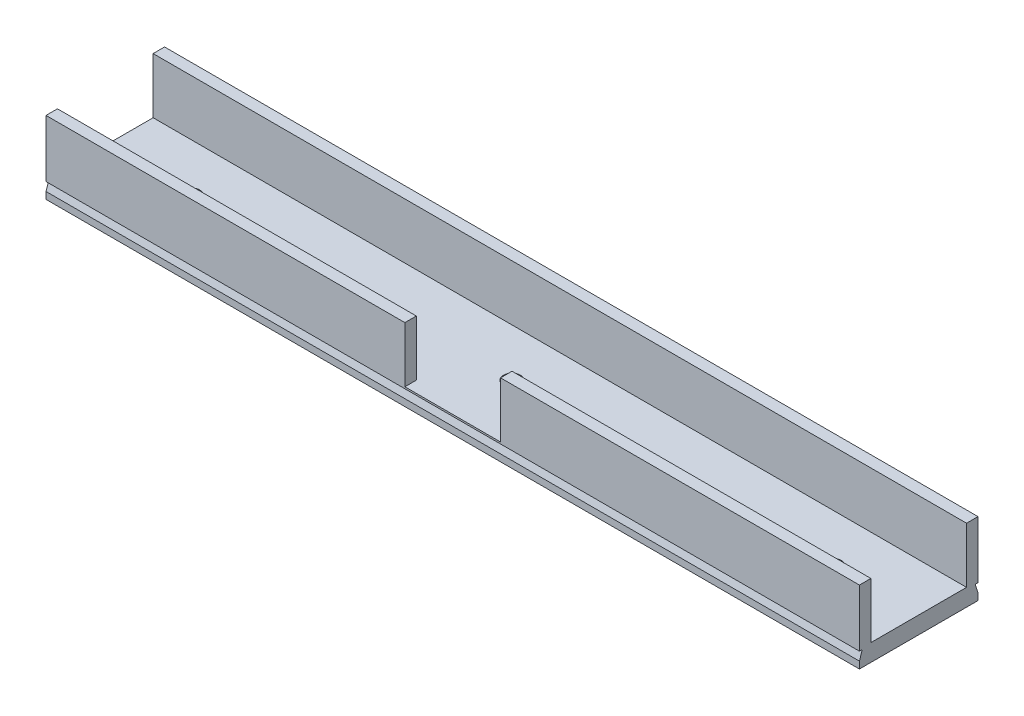
ISO-10303-21;
HEADER;
FILE_DESCRIPTION(('STEP AP214'),'2;1');
FILE_NAME('part.step','',(''),(''),'','','');
FILE_SCHEMA(('AUTOMOTIVE_DESIGN { 1 0 10303 214 1 1 1 1 }'));
ENDSEC;
DATA;
#1=APPLICATION_CONTEXT('core data for automotive mechanical design processes');
#2=APPLICATION_PROTOCOL_DEFINITION('international standard','automotive_design',2000,#1);
#3=PRODUCT_CONTEXT('',#1,'mechanical');
#4=PRODUCT('Part','Part','',(#3));
#5=PRODUCT_RELATED_PRODUCT_CATEGORY('part','',(#4));
#6=PRODUCT_DEFINITION_FORMATION('','',#4);
#7=PRODUCT_DEFINITION_CONTEXT('part definition',#1,'design');
#8=PRODUCT_DEFINITION('design','',#6,#7);
#9=PRODUCT_DEFINITION_SHAPE('','',#8);
#10=(LENGTH_UNIT() NAMED_UNIT(*) SI_UNIT(.MILLI.,.METRE.));
#11=(NAMED_UNIT(*) PLANE_ANGLE_UNIT() SI_UNIT($,.RADIAN.));
#12=(NAMED_UNIT(*) SI_UNIT($,.STERADIAN.) SOLID_ANGLE_UNIT());
#13=UNCERTAINTY_MEASURE_WITH_UNIT(LENGTH_MEASURE(1.E-05),#10,'distance_accuracy_value','');
#14=(GEOMETRIC_REPRESENTATION_CONTEXT(3) GLOBAL_UNCERTAINTY_ASSIGNED_CONTEXT((#13)) GLOBAL_UNIT_ASSIGNED_CONTEXT((#10,
#11,#12)) REPRESENTATION_CONTEXT('',''));
#15=CARTESIAN_POINT('',(0.,0.,0.));
#16=DIRECTION('',(0.,0.,1.));
#17=DIRECTION('',(1.,0.,0.));
#18=AXIS2_PLACEMENT_3D('',#15,#16,#17);
#19=CARTESIAN_POINT('',(71.,12.7,8.35));
#20=DIRECTION('',(0.,0.,1.));
#21=DIRECTION('',(1.,0.,0.));
#22=AXIS2_PLACEMENT_3D('',#19,#20,#21);
#23=PLANE('',#22);
#24=DIRECTION('',(-1.,0.,0.));
#25=VECTOR('',#24,1.);
#26=CARTESIAN_POINT('',(71.,12.7,8.35));
#27=LINE('',#26,#25);
#28=CARTESIAN_POINT('',(-8.35,12.7,8.35));
#29=VERTEX_POINT('',#28);
#30=CARTESIAN_POINT('',(-71.,12.7,8.35000000000002));
#31=VERTEX_POINT('',#30);
#32=EDGE_CURVE('E224',#29,#31,#27,.T.);
#33=ORIENTED_EDGE('',*,*,#32,.F.);
#34=DIRECTION('',(0.,-1.,0.));
#35=VECTOR('',#34,1.);
#36=CARTESIAN_POINT('',(-8.35,12.7,8.35000000000001));
#37=LINE('',#36,#35);
#38=CARTESIAN_POINT('',(-8.35,2.99999999999999,8.35000000000001));
#39=VERTEX_POINT('',#38);
#40=EDGE_CURVE('E190',#29,#39,#37,.T.);
#41=ORIENTED_EDGE('',*,*,#40,.T.);
#42=DIRECTION('',(-1.,0.,0.));
#43=VECTOR('',#42,1.);
#44=CARTESIAN_POINT('',(71.,3.,8.35));
#45=LINE('',#44,#43);
#46=CARTESIAN_POINT('',(-71.,3.,8.35000000000002));
#47=VERTEX_POINT('',#46);
#48=EDGE_CURVE('E168',#39,#47,#45,.T.);
#49=ORIENTED_EDGE('',*,*,#48,.T.);
#50=DIRECTION('',(0.,-1.,0.));
#51=VECTOR('',#50,1.);
#52=CARTESIAN_POINT('',(-71.,12.7,8.35000000000002));
#53=LINE('',#52,#51);
#54=EDGE_CURVE('E235',#31,#47,#53,.T.);
#55=ORIENTED_EDGE('',*,*,#54,.F.);
#56=EDGE_LOOP('',(#33,#41,#49,#55));
#57=FACE_BOUND('',#56,.T.);
#58=ADVANCED_FACE('F35',(#57),#23,.F.);
#59=CARTESIAN_POINT('',(0.,12.7,0.));
#60=DIRECTION('',(0.,1.,0.));
#61=DIRECTION('',(0.,0.,1.));
#62=AXIS2_PLACEMENT_3D('',#59,#60,#61);
#63=PLANE('',#62);
#64=DIRECTION('',(0.,0.,1.));
#65=VECTOR('',#64,1.);
#66=CARTESIAN_POINT('',(-8.35,12.7,0.));
#67=LINE('',#66,#65);
#68=CARTESIAN_POINT('',(-8.35,12.7,10.35));
#69=VERTEX_POINT('',#68);
#70=EDGE_CURVE('E11',#29,#69,#67,.T.);
#71=ORIENTED_EDGE('',*,*,#70,.F.);
#72=ORIENTED_EDGE('',*,*,#32,.T.);
#73=DIRECTION('',(0.,0.,1.));
#74=VECTOR('',#73,1.);
#75=CARTESIAN_POINT('',(-71.,12.7,8.35000000000002));
#76=LINE('',#75,#74);
#77=CARTESIAN_POINT('',(-71.,12.7,10.35));
#78=VERTEX_POINT('',#77);
#79=EDGE_CURVE('E229',#31,#78,#76,.T.);
#80=ORIENTED_EDGE('',*,*,#79,.T.);
#81=DIRECTION('',(1.,0.,0.));
#82=VECTOR('',#81,1.);
#83=CARTESIAN_POINT('',(-71.,12.7,10.35));
#84=LINE('',#83,#82);
#85=EDGE_CURVE('E233',#78,#69,#84,.T.);
#86=ORIENTED_EDGE('',*,*,#85,.T.);
#87=EDGE_LOOP('',(#71,#72,#80,#86));
#88=FACE_BOUND('',#87,.T.);
#89=ADVANCED_FACE('F341',(#88),#63,.T.);
#90=CARTESIAN_POINT('',(0.,3.,-10.35));
#91=DIRECTION('',(0.,0.,1.));
#92=DIRECTION('',(1.,0.,0.));
#93=AXIS2_PLACEMENT_3D('',#90,#91,#92);
#94=PLANE('',#93);
#95=DIRECTION('',(0.,-1.,0.));
#96=VECTOR('',#95,1.);
#97=CARTESIAN_POINT('',(71.,3.,-10.35));
#98=LINE('',#97,#96);
#99=CARTESIAN_POINT('',(71.,12.7,-10.35));
#100=VERTEX_POINT('',#99);
#101=CARTESIAN_POINT('',(71.,2.7,-10.35));
#102=VERTEX_POINT('',#101);
#103=EDGE_CURVE('E309',#100,#102,#98,.T.);
#104=ORIENTED_EDGE('',*,*,#103,.T.);
#105=DIRECTION('',(-1.,0.,0.));
#106=VECTOR('',#105,1.);
#107=CARTESIAN_POINT('',(153.,2.7,-10.35));
#108=LINE('',#107,#106);
#109=CARTESIAN_POINT('',(-71.,2.7,-10.35));
#110=VERTEX_POINT('',#109);
#111=EDGE_CURVE('E198',#102,#110,#108,.T.);
#112=ORIENTED_EDGE('',*,*,#111,.T.);
#113=DIRECTION('',(0.,-1.,0.));
#114=VECTOR('',#113,1.);
#115=CARTESIAN_POINT('',(-71.,3.,-10.35));
#116=LINE('',#115,#114);
#117=CARTESIAN_POINT('',(-71.,12.7,-10.35));
#118=VERTEX_POINT('',#117);
#119=EDGE_CURVE('E305',#118,#110,#116,.T.);
#120=ORIENTED_EDGE('',*,*,#119,.F.);
#121=DIRECTION('',(-1.,0.,0.));
#122=VECTOR('',#121,1.);
#123=CARTESIAN_POINT('',(-71.,12.7,-10.35));
#124=LINE('',#123,#122);
#125=EDGE_CURVE('E249',#100,#118,#124,.T.);
#126=ORIENTED_EDGE('',*,*,#125,.F.);
#127=EDGE_LOOP('',(#104,#112,#120,#126));
#128=FACE_BOUND('',#127,.T.);
#129=ADVANCED_FACE('F370',(#128),#94,.F.);
#130=CARTESIAN_POINT('',(0.,3.,10.35));
#131=DIRECTION('',(0.,0.,1.));
#132=DIRECTION('',(1.,0.,0.));
#133=AXIS2_PLACEMENT_3D('',#130,#131,#132);
#134=PLANE('',#133);
#135=DIRECTION('',(1.,0.,0.));
#136=VECTOR('',#135,1.);
#137=CARTESIAN_POINT('',(0.,1.20000000000002,10.35));
#138=LINE('',#137,#136);
#139=CARTESIAN_POINT('',(-71.,1.2,10.35));
#140=VERTEX_POINT('',#139);
#141=CARTESIAN_POINT('',(71.,1.2,10.35));
#142=VERTEX_POINT('',#141);
#143=EDGE_CURVE('E314',#140,#142,#138,.T.);
#144=ORIENTED_EDGE('',*,*,#143,.F.);
#145=DIRECTION('',(0.,-1.,0.));
#146=VECTOR('',#145,1.);
#147=CARTESIAN_POINT('',(-71.,3.,10.35));
#148=LINE('',#147,#146);
#149=CARTESIAN_POINT('',(-71.,0.,10.35));
#150=VERTEX_POINT('',#149);
#151=EDGE_CURVE('E300',#140,#150,#148,.T.);
#152=ORIENTED_EDGE('',*,*,#151,.T.);
#153=DIRECTION('',(-1.,0.,0.));
#154=VECTOR('',#153,1.);
#155=CARTESIAN_POINT('',(0.,0.,10.35));
#156=LINE('',#155,#154);
#157=CARTESIAN_POINT('',(71.,0.,10.35));
#158=VERTEX_POINT('',#157);
#159=EDGE_CURVE('E284',#158,#150,#156,.T.);
#160=ORIENTED_EDGE('',*,*,#159,.F.);
#161=DIRECTION('',(0.,-1.,0.));
#162=VECTOR('',#161,1.);
#163=CARTESIAN_POINT('',(71.,3.,10.35));
#164=LINE('',#163,#162);
#165=EDGE_CURVE('E286',#142,#158,#164,.T.);
#166=ORIENTED_EDGE('',*,*,#165,.F.);
#167=EDGE_LOOP('',(#144,#152,#160,#166));
#168=FACE_BOUND('',#167,.T.);
#169=ADVANCED_FACE('F355',(#168),#134,.T.);
#170=CARTESIAN_POINT('',(0.,3.,0.));
#171=DIRECTION('',(0.,1.,0.));
#172=DIRECTION('',(0.,0.,1.));
#173=AXIS2_PLACEMENT_3D('',#170,#171,#172);
#174=PLANE('',#173);
#175=ORIENTED_EDGE('',*,*,#48,.F.);
#176=DIRECTION('',(0.,0.,1.));
#177=VECTOR('',#176,1.);
#178=CARTESIAN_POINT('',(-8.35,2.99999999999999,0.349999999999998));
#179=LINE('',#178,#177);
#180=CARTESIAN_POINT('',(-8.35,2.99999999999999,10.35));
#181=VERTEX_POINT('',#180);
#182=EDGE_CURVE('E160',#39,#181,#179,.T.);
#183=ORIENTED_EDGE('',*,*,#182,.T.);
#184=DIRECTION('',(1.,0.,0.));
#185=VECTOR('',#184,1.);
#186=CARTESIAN_POINT('',(-8.35,2.99999999999999,10.35));
#187=LINE('',#186,#185);
#188=CARTESIAN_POINT('',(8.35,2.99999999999999,10.35));
#189=VERTEX_POINT('',#188);
#190=EDGE_CURVE('E166',#181,#189,#187,.T.);
#191=ORIENTED_EDGE('',*,*,#190,.T.);
#192=DIRECTION('',(0.,0.,1.));
#193=VECTOR('',#192,1.);
#194=CARTESIAN_POINT('',(8.35,2.99999999999999,0.349999999999998));
#195=LINE('',#194,#193);
#196=CARTESIAN_POINT('',(8.35,2.99999999999999,8.35000000000001));
#197=VERTEX_POINT('',#196);
#198=EDGE_CURVE('E171',#197,#189,#195,.T.);
#199=ORIENTED_EDGE('',*,*,#198,.F.);
#200=CARTESIAN_POINT('',(71.,3.,8.35));
#201=VERTEX_POINT('',#200);
#202=EDGE_CURVE('E225',#201,#197,#45,.T.);
#203=ORIENTED_EDGE('',*,*,#202,.F.);
#204=DIRECTION('',(0.,0.,-1.));
#205=VECTOR('',#204,1.);
#206=CARTESIAN_POINT('',(71.,3.,0.));
#207=LINE('',#206,#205);
#208=CARTESIAN_POINT('',(71.,3.,-8.35000000000002));
#209=VERTEX_POINT('',#208);
#210=EDGE_CURVE('E281',#201,#209,#207,.T.);
#211=ORIENTED_EDGE('',*,*,#210,.T.);
#212=DIRECTION('',(1.,0.,0.));
#213=VECTOR('',#212,1.);
#214=CARTESIAN_POINT('',(71.,3.,-8.35000000000002));
#215=LINE('',#214,#213);
#216=CARTESIAN_POINT('',(-71.,3.,-8.35000000000001));
#217=VERTEX_POINT('',#216);
#218=EDGE_CURVE('E242',#217,#209,#215,.T.);
#219=ORIENTED_EDGE('',*,*,#218,.F.);
#220=DIRECTION('',(0.,0.,-1.));
#221=VECTOR('',#220,1.);
#222=CARTESIAN_POINT('',(-71.,3.,0.));
#223=LINE('',#222,#221);
#224=EDGE_CURVE('E283',#47,#217,#223,.T.);
#225=ORIENTED_EDGE('',*,*,#224,.F.);
#226=EDGE_LOOP('',(#175,#183,#191,#199,#203,#211,#219,#225));
#227=FACE_BOUND('',#226,.T.);
#228=CARTESIAN_POINT('',(0.,3.,0.));
#229=DIRECTION('',(0.,1.,0.));
#230=DIRECTION('',(0.,0.,1.));
#231=AXIS2_PLACEMENT_3D('',#228,#229,#230);
#232=CIRCLE('',#231,1.5);
#233=CARTESIAN_POINT('',(0.,3.,1.5));
#234=VERTEX_POINT('',#233);
#235=EDGE_CURVE('E273',#234,#234,#232,.T.);
#236=ORIENTED_EDGE('',*,*,#235,.F.);
#237=EDGE_LOOP('',(#236));
#238=FACE_BOUND('',#237,.T.);
#239=CARTESIAN_POINT('',(-56.,3.,0.));
#240=DIRECTION('',(0.,1.,0.));
#241=DIRECTION('',(0.,0.,1.));
#242=AXIS2_PLACEMENT_3D('',#239,#240,#241);
#243=CIRCLE('',#242,1.5);
#244=CARTESIAN_POINT('',(-56.,3.,1.5));
#245=VERTEX_POINT('',#244);
#246=EDGE_CURVE('E267',#245,#245,#243,.T.);
#247=ORIENTED_EDGE('',*,*,#246,.F.);
#248=EDGE_LOOP('',(#247));
#249=FACE_BOUND('',#248,.T.);
#250=CARTESIAN_POINT('',(56.,3.,0.));
#251=DIRECTION('',(0.,1.,0.));
#252=DIRECTION('',(0.,0.,-1.));
#253=AXIS2_PLACEMENT_3D('',#250,#251,#252);
#254=CIRCLE('',#253,1.5);
#255=CARTESIAN_POINT('',(56.,3.,-1.5));
#256=VERTEX_POINT('',#255);
#257=EDGE_CURVE('E262',#256,#256,#254,.T.);
#258=ORIENTED_EDGE('',*,*,#257,.F.);
#259=EDGE_LOOP('',(#258));
#260=FACE_BOUND('',#259,.T.);
#261=ADVANCED_FACE('F162',(#227,#238,#249,#260),#174,.T.);
#262=CARTESIAN_POINT('',(71.,3.,0.));
#263=DIRECTION('',(-1.,0.,0.));
#264=DIRECTION('',(0.,0.,1.));
#265=AXIS2_PLACEMENT_3D('',#262,#263,#264);
#266=PLANE('',#265);
#267=DIRECTION('',(0.,0.948683298050513,0.316227766016839));
#268=VECTOR('',#267,1.);
#269=CARTESIAN_POINT('',(71.,5.92500000000001,-8.77499999999999));
#270=LINE('',#269,#268);
#271=CARTESIAN_POINT('',(71.,1.2,-10.35));
#272=VERTEX_POINT('',#271);
#273=CARTESIAN_POINT('',(71.,2.7,-9.85));
#274=VERTEX_POINT('',#273);
#275=EDGE_CURVE('E215',#272,#274,#270,.T.);
#276=ORIENTED_EDGE('',*,*,#275,.T.);
#277=DIRECTION('',(0.,0.,-1.));
#278=VECTOR('',#277,1.);
#279=CARTESIAN_POINT('',(71.,2.7,0.));
#280=LINE('',#279,#278);
#281=EDGE_CURVE('E218',#274,#102,#280,.T.);
#282=ORIENTED_EDGE('',*,*,#281,.T.);
#283=ORIENTED_EDGE('',*,*,#103,.F.);
#284=DIRECTION('',(0.,0.,-1.));
#285=VECTOR('',#284,1.);
#286=CARTESIAN_POINT('',(71.,12.7,-10.35));
#287=LINE('',#286,#285);
#288=CARTESIAN_POINT('',(71.,12.7,-8.35000000000002));
#289=VERTEX_POINT('',#288);
#290=EDGE_CURVE('E246',#289,#100,#287,.T.);
#291=ORIENTED_EDGE('',*,*,#290,.F.);
#292=DIRECTION('',(0.,-1.,0.));
#293=VECTOR('',#292,1.);
#294=CARTESIAN_POINT('',(71.,12.7,-8.35000000000002));
#295=LINE('',#294,#293);
#296=EDGE_CURVE('E259',#289,#209,#295,.T.);
#297=ORIENTED_EDGE('',*,*,#296,.T.);
#298=ORIENTED_EDGE('',*,*,#210,.F.);
#299=DIRECTION('',(0.,-1.,0.));
#300=VECTOR('',#299,1.);
#301=CARTESIAN_POINT('',(71.,12.7,8.35));
#302=LINE('',#301,#300);
#303=CARTESIAN_POINT('',(71.,12.7,8.35));
#304=VERTEX_POINT('',#303);
#305=EDGE_CURVE('E240',#304,#201,#302,.T.);
#306=ORIENTED_EDGE('',*,*,#305,.F.);
#307=DIRECTION('',(0.,0.,-1.));
#308=VECTOR('',#307,1.);
#309=CARTESIAN_POINT('',(71.,12.7,10.35));
#310=LINE('',#309,#308);
#311=CARTESIAN_POINT('',(71.,12.7,10.35));
#312=VERTEX_POINT('',#311);
#313=EDGE_CURVE('E221',#312,#304,#310,.T.);
#314=ORIENTED_EDGE('',*,*,#313,.F.);
#315=CARTESIAN_POINT('',(71.,2.7,10.35));
#316=VERTEX_POINT('',#315);
#317=EDGE_CURVE('E297',#312,#316,#164,.T.);
#318=ORIENTED_EDGE('',*,*,#317,.T.);
#319=DIRECTION('',(0.,0.,-1.));
#320=VECTOR('',#319,1.);
#321=CARTESIAN_POINT('',(71.,2.7,0.));
#322=LINE('',#321,#320);
#323=CARTESIAN_POINT('',(71.,2.7,9.85));
#324=VERTEX_POINT('',#323);
#325=EDGE_CURVE('E201',#316,#324,#322,.T.);
#326=ORIENTED_EDGE('',*,*,#325,.T.);
#327=DIRECTION('',(0.,-0.948683298050513,0.316227766016839));
#328=VECTOR('',#327,1.);
#329=CARTESIAN_POINT('',(71.,5.92500000000001,8.77499999999999));
#330=LINE('',#329,#328);
#331=EDGE_CURVE('E212',#324,#142,#330,.T.);
#332=ORIENTED_EDGE('',*,*,#331,.T.);
#333=ORIENTED_EDGE('',*,*,#165,.T.);
#334=DIRECTION('',(0.,0.,-1.));
#335=VECTOR('',#334,1.);
#336=CARTESIAN_POINT('',(71.,0.,0.));
#337=LINE('',#336,#335);
#338=CARTESIAN_POINT('',(71.,0.,-10.35));
#339=VERTEX_POINT('',#338);
#340=EDGE_CURVE('E266',#158,#339,#337,.T.);
#341=ORIENTED_EDGE('',*,*,#340,.T.);
#342=EDGE_CURVE('E308',#272,#339,#98,.T.);
#343=ORIENTED_EDGE('',*,*,#342,.F.);
#344=EDGE_LOOP('',(#276,#282,#283,#291,#297,#298,#306,#314,#318,#326,#332,#333,#341,#343));
#345=FACE_BOUND('',#344,.T.);
#346=ADVANCED_FACE('F37',(#345),#266,.F.);
#347=CARTESIAN_POINT('',(-71.,1.2,-10.35));
#348=VERTEX_POINT('',#347);
#349=CARTESIAN_POINT('',(-71.,0.,-10.35));
#350=VERTEX_POINT('',#349);
#351=EDGE_CURVE('E304',#348,#350,#116,.T.);
#352=ORIENTED_EDGE('',*,*,#351,.F.);
#353=DIRECTION('',(-1.,0.,0.));
#354=VECTOR('',#353,1.);
#355=CARTESIAN_POINT('',(153.,1.2,-10.35));
#356=LINE('',#355,#354);
#357=EDGE_CURVE('E58',#272,#348,#356,.T.);
#358=ORIENTED_EDGE('',*,*,#357,.F.);
#359=ORIENTED_EDGE('',*,*,#342,.T.);
#360=DIRECTION('',(-1.,0.,0.));
#361=VECTOR('',#360,1.);
#362=CARTESIAN_POINT('',(0.,0.,-10.35));
#363=LINE('',#362,#361);
#364=EDGE_CURVE('E289',#339,#350,#363,.T.);
#365=ORIENTED_EDGE('',*,*,#364,.T.);
#366=EDGE_LOOP('',(#352,#358,#359,#365));
#367=FACE_BOUND('',#366,.T.);
#368=ADVANCED_FACE('F363',(#367),#94,.F.);
#369=CARTESIAN_POINT('',(-71.,3.,0.));
#370=DIRECTION('',(-1.,0.,0.));
#371=DIRECTION('',(0.,0.,1.));
#372=AXIS2_PLACEMENT_3D('',#369,#370,#371);
#373=PLANE('',#372);
#374=DIRECTION('',(0.,0.,-1.));
#375=VECTOR('',#374,1.);
#376=CARTESIAN_POINT('',(-71.,2.7,-10.35));
#377=LINE('',#376,#375);
#378=CARTESIAN_POINT('',(-71.,2.7,-9.85));
#379=VERTEX_POINT('',#378);
#380=EDGE_CURVE('E195',#379,#110,#377,.T.);
#381=ORIENTED_EDGE('',*,*,#380,.F.);
#382=DIRECTION('',(0.,0.948683298050513,0.316227766016839));
#383=VECTOR('',#382,1.);
#384=CARTESIAN_POINT('',(-71.,2.7,-9.85));
#385=LINE('',#384,#383);
#386=EDGE_CURVE('E193',#348,#379,#385,.T.);
#387=ORIENTED_EDGE('',*,*,#386,.F.);
#388=ORIENTED_EDGE('',*,*,#351,.T.);
#389=DIRECTION('',(0.,0.,-1.));
#390=VECTOR('',#389,1.);
#391=CARTESIAN_POINT('',(-71.,0.,0.));
#392=LINE('',#391,#390);
#393=EDGE_CURVE('E292',#150,#350,#392,.T.);
#394=ORIENTED_EDGE('',*,*,#393,.F.);
#395=ORIENTED_EDGE('',*,*,#151,.F.);
#396=DIRECTION('',(0.,-0.948683298050513,0.316227766016839));
#397=VECTOR('',#396,1.);
#398=CARTESIAN_POINT('',(-71.,2.7,9.85));
#399=LINE('',#398,#397);
#400=CARTESIAN_POINT('',(-71.,2.7,9.85));
#401=VERTEX_POINT('',#400);
#402=EDGE_CURVE('E207',#401,#140,#399,.T.);
#403=ORIENTED_EDGE('',*,*,#402,.F.);
#404=DIRECTION('',(0.,0.,-1.));
#405=VECTOR('',#404,1.);
#406=CARTESIAN_POINT('',(-71.,2.7,10.35));
#407=LINE('',#406,#405);
#408=CARTESIAN_POINT('',(-71.,2.7,10.35));
#409=VERTEX_POINT('',#408);
#410=EDGE_CURVE('E192',#409,#401,#407,.T.);
#411=ORIENTED_EDGE('',*,*,#410,.F.);
#412=EDGE_CURVE('E301',#78,#409,#148,.T.);
#413=ORIENTED_EDGE('',*,*,#412,.F.);
#414=ORIENTED_EDGE('',*,*,#79,.F.);
#415=ORIENTED_EDGE('',*,*,#54,.T.);
#416=ORIENTED_EDGE('',*,*,#224,.T.);
#417=DIRECTION('',(0.,-1.,0.));
#418=VECTOR('',#417,1.);
#419=CARTESIAN_POINT('',(-71.,12.7,-8.35));
#420=LINE('',#419,#418);
#421=CARTESIAN_POINT('',(-71.,12.7,-8.35));
#422=VERTEX_POINT('',#421);
#423=EDGE_CURVE('E254',#422,#217,#420,.T.);
#424=ORIENTED_EDGE('',*,*,#423,.F.);
#425=DIRECTION('',(0.,0.,1.));
#426=VECTOR('',#425,1.);
#427=CARTESIAN_POINT('',(-71.,12.7,-8.35));
#428=LINE('',#427,#426);
#429=EDGE_CURVE('E252',#118,#422,#428,.T.);
#430=ORIENTED_EDGE('',*,*,#429,.F.);
#431=ORIENTED_EDGE('',*,*,#119,.T.);
#432=EDGE_LOOP('',(#381,#387,#388,#394,#395,#403,#411,#413,#414,#415,#416,#424,#430,#431));
#433=FACE_BOUND('',#432,.T.);
#434=ADVANCED_FACE('F335',(#433),#373,.T.);
#435=DIRECTION('',(0.,-1.,0.));
#436=VECTOR('',#435,1.);
#437=CARTESIAN_POINT('',(-8.35,2.99999999999999,10.35));
#438=LINE('',#437,#436);
#439=EDGE_CURVE('E174',#69,#181,#438,.T.);
#440=ORIENTED_EDGE('',*,*,#439,.F.);
#441=ORIENTED_EDGE('',*,*,#85,.F.);
#442=ORIENTED_EDGE('',*,*,#412,.T.);
#443=DIRECTION('',(-1.,0.,0.));
#444=VECTOR('',#443,1.);
#445=CARTESIAN_POINT('',(0.,2.7,10.35));
#446=LINE('',#445,#444);
#447=EDGE_CURVE('E312',#316,#409,#446,.T.);
#448=ORIENTED_EDGE('',*,*,#447,.F.);
#449=ORIENTED_EDGE('',*,*,#317,.F.);
#450=CARTESIAN_POINT('',(8.35,12.7,10.35));
#451=VERTEX_POINT('',#450);
#452=EDGE_CURVE('E232',#451,#312,#84,.T.);
#453=ORIENTED_EDGE('',*,*,#452,.F.);
#454=DIRECTION('',(0.,1.,0.));
#455=VECTOR('',#454,1.);
#456=CARTESIAN_POINT('',(8.35,2.99999999999999,10.35));
#457=LINE('',#456,#455);
#458=EDGE_CURVE('E50',#189,#451,#457,.T.);
#459=ORIENTED_EDGE('',*,*,#458,.F.);
#460=ORIENTED_EDGE('',*,*,#190,.F.);
#461=EDGE_LOOP('',(#440,#441,#442,#448,#449,#453,#459,#460));
#462=FACE_BOUND('',#461,.T.);
#463=ADVANCED_FACE('F181',(#462),#134,.T.);
#464=CARTESIAN_POINT('',(0.,0.,0.));
#465=DIRECTION('',(0.,1.,0.));
#466=DIRECTION('',(0.,0.,1.));
#467=AXIS2_PLACEMENT_3D('',#464,#465,#466);
#468=PLANE('',#467);
#469=CARTESIAN_POINT('',(-56.,0.,0.));
#470=DIRECTION('',(0.,1.,0.));
#471=DIRECTION('',(0.,0.,1.));
#472=AXIS2_PLACEMENT_3D('',#469,#470,#471);
#473=CIRCLE('',#472,1.5);
#474=CARTESIAN_POINT('',(-56.,0.,1.5));
#475=VERTEX_POINT('',#474);
#476=EDGE_CURVE('E263',#475,#475,#473,.T.);
#477=ORIENTED_EDGE('',*,*,#476,.T.);
#478=EDGE_LOOP('',(#477));
#479=FACE_BOUND('',#478,.T.);
#480=CARTESIAN_POINT('',(0.,0.,0.));
#481=DIRECTION('',(0.,1.,0.));
#482=DIRECTION('',(0.,0.,1.));
#483=AXIS2_PLACEMENT_3D('',#480,#481,#482);
#484=CIRCLE('',#483,1.5);
#485=CARTESIAN_POINT('',(0.,0.,1.5));
#486=VERTEX_POINT('',#485);
#487=EDGE_CURVE('E270',#486,#486,#484,.T.);
#488=ORIENTED_EDGE('',*,*,#487,.T.);
#489=EDGE_LOOP('',(#488));
#490=FACE_BOUND('',#489,.T.);
#491=CARTESIAN_POINT('',(56.,0.,0.));
#492=DIRECTION('',(0.,1.,0.));
#493=DIRECTION('',(0.,0.,-1.));
#494=AXIS2_PLACEMENT_3D('',#491,#492,#493);
#495=CIRCLE('',#494,1.5);
#496=CARTESIAN_POINT('',(56.,0.,-1.5));
#497=VERTEX_POINT('',#496);
#498=EDGE_CURVE('E276',#497,#497,#495,.T.);
#499=ORIENTED_EDGE('',*,*,#498,.T.);
#500=EDGE_LOOP('',(#499));
#501=FACE_BOUND('',#500,.T.);
#502=ORIENTED_EDGE('',*,*,#340,.F.);
#503=ORIENTED_EDGE('',*,*,#159,.T.);
#504=ORIENTED_EDGE('',*,*,#393,.T.);
#505=ORIENTED_EDGE('',*,*,#364,.F.);
#506=EDGE_LOOP('',(#502,#503,#504,#505));
#507=FACE_BOUND('',#506,.T.);
#508=ADVANCED_FACE('F358',(#479,#490,#501,#507),#468,.F.);
#509=CARTESIAN_POINT('',(56.,0.,0.));
#510=DIRECTION('',(0.,1.,0.));
#511=DIRECTION('',(0.,0.,1.));
#512=AXIS2_PLACEMENT_3D('',#509,#510,#511);
#513=CYLINDRICAL_SURFACE('',#512,1.5);
#514=ORIENTED_EDGE('',*,*,#498,.F.);
#515=EDGE_LOOP('',(#514));
#516=FACE_BOUND('',#515,.T.);
#517=ORIENTED_EDGE('',*,*,#257,.T.);
#518=EDGE_LOOP('',(#517));
#519=FACE_BOUND('',#518,.T.);
#520=ADVANCED_FACE('F443',(#516,#519),#513,.F.);
#521=CARTESIAN_POINT('',(0.,0.,0.));
#522=DIRECTION('',(0.,1.,0.));
#523=DIRECTION('',(0.,0.,1.));
#524=AXIS2_PLACEMENT_3D('',#521,#522,#523);
#525=CYLINDRICAL_SURFACE('',#524,1.5);
#526=ORIENTED_EDGE('',*,*,#487,.F.);
#527=EDGE_LOOP('',(#526));
#528=FACE_BOUND('',#527,.T.);
#529=ORIENTED_EDGE('',*,*,#235,.T.);
#530=EDGE_LOOP('',(#529));
#531=FACE_BOUND('',#530,.T.);
#532=ADVANCED_FACE('F438',(#528,#531),#525,.F.);
#533=CARTESIAN_POINT('',(-56.,0.,0.));
#534=DIRECTION('',(0.,1.,0.));
#535=DIRECTION('',(0.,0.,1.));
#536=AXIS2_PLACEMENT_3D('',#533,#534,#535);
#537=CYLINDRICAL_SURFACE('',#536,1.5);
#538=ORIENTED_EDGE('',*,*,#476,.F.);
#539=EDGE_LOOP('',(#538));
#540=FACE_BOUND('',#539,.T.);
#541=ORIENTED_EDGE('',*,*,#246,.T.);
#542=EDGE_LOOP('',(#541));
#543=FACE_BOUND('',#542,.T.);
#544=ADVANCED_FACE('F380',(#540,#543),#537,.F.);
#545=CARTESIAN_POINT('',(71.,12.7,-8.35000000000002));
#546=DIRECTION('',(0.,0.,-1.));
#547=DIRECTION('',(-1.,0.,0.));
#548=AXIS2_PLACEMENT_3D('',#545,#546,#547);
#549=PLANE('',#548);
#550=ORIENTED_EDGE('',*,*,#218,.T.);
#551=ORIENTED_EDGE('',*,*,#296,.F.);
#552=DIRECTION('',(1.,0.,0.));
#553=VECTOR('',#552,1.);
#554=CARTESIAN_POINT('',(71.,12.7,-8.35000000000002));
#555=LINE('',#554,#553);
#556=EDGE_CURVE('E243',#422,#289,#555,.T.);
#557=ORIENTED_EDGE('',*,*,#556,.F.);
#558=ORIENTED_EDGE('',*,*,#423,.T.);
#559=EDGE_LOOP('',(#550,#551,#557,#558));
#560=FACE_BOUND('',#559,.T.);
#561=ADVANCED_FACE('F330',(#560),#549,.F.);
#562=CARTESIAN_POINT('',(0.,12.7,0.));
#563=DIRECTION('',(0.,-1.,0.));
#564=DIRECTION('',(0.,0.,-1.));
#565=AXIS2_PLACEMENT_3D('',#562,#563,#564);
#566=PLANE('',#565);
#567=ORIENTED_EDGE('',*,*,#556,.T.);
#568=ORIENTED_EDGE('',*,*,#290,.T.);
#569=ORIENTED_EDGE('',*,*,#125,.T.);
#570=ORIENTED_EDGE('',*,*,#429,.T.);
#571=EDGE_LOOP('',(#567,#568,#569,#570));
#572=FACE_BOUND('',#571,.T.);
#573=ADVANCED_FACE('F372',(#572),#566,.F.);
#574=ORIENTED_EDGE('',*,*,#202,.T.);
#575=DIRECTION('',(0.,1.,0.));
#576=VECTOR('',#575,1.);
#577=CARTESIAN_POINT('',(8.35,12.7,8.35000000000001));
#578=LINE('',#577,#576);
#579=CARTESIAN_POINT('',(8.35,12.7,8.35));
#580=VERTEX_POINT('',#579);
#581=EDGE_CURVE('E186',#197,#580,#578,.T.);
#582=ORIENTED_EDGE('',*,*,#581,.T.);
#583=EDGE_CURVE('E226',#304,#580,#27,.T.);
#584=ORIENTED_EDGE('',*,*,#583,.F.);
#585=ORIENTED_EDGE('',*,*,#305,.T.);
#586=EDGE_LOOP('',(#574,#582,#584,#585));
#587=FACE_BOUND('',#586,.T.);
#588=ADVANCED_FACE('F318',(#587),#23,.F.);
#589=DIRECTION('',(0.,0.,-1.));
#590=VECTOR('',#589,1.);
#591=CARTESIAN_POINT('',(8.35,12.7,0.));
#592=LINE('',#591,#590);
#593=EDGE_CURVE('E43',#451,#580,#592,.T.);
#594=ORIENTED_EDGE('',*,*,#593,.F.);
#595=ORIENTED_EDGE('',*,*,#452,.T.);
#596=ORIENTED_EDGE('',*,*,#313,.T.);
#597=ORIENTED_EDGE('',*,*,#583,.T.);
#598=EDGE_LOOP('',(#594,#595,#596,#597));
#599=FACE_BOUND('',#598,.T.);
#600=ADVANCED_FACE('F320',(#599),#63,.T.);
#601=CARTESIAN_POINT('',(153.,2.7,9.85));
#602=DIRECTION('',(0.,-0.316227766016839,-0.948683298050513));
#603=DIRECTION('',(0.,0.948683298050513,-0.316227766016839));
#604=AXIS2_PLACEMENT_3D('',#601,#602,#603);
#605=PLANE('',#604);
#606=DIRECTION('',(-1.,0.,0.));
#607=VECTOR('',#606,1.);
#608=CARTESIAN_POINT('',(153.,2.7,9.85));
#609=LINE('',#608,#607);
#610=EDGE_CURVE('E196',#324,#401,#609,.T.);
#611=ORIENTED_EDGE('',*,*,#610,.T.);
#612=ORIENTED_EDGE('',*,*,#402,.T.);
#613=ORIENTED_EDGE('',*,*,#143,.T.);
#614=ORIENTED_EDGE('',*,*,#331,.F.);
#615=EDGE_LOOP('',(#611,#612,#613,#614));
#616=FACE_BOUND('',#615,.T.);
#617=ADVANCED_FACE('F389',(#616),#605,.F.);
#618=CARTESIAN_POINT('',(153.,2.7,10.35));
#619=DIRECTION('',(0.,1.,0.));
#620=DIRECTION('',(0.,0.,1.));
#621=AXIS2_PLACEMENT_3D('',#618,#619,#620);
#622=PLANE('',#621);
#623=ORIENTED_EDGE('',*,*,#447,.T.);
#624=ORIENTED_EDGE('',*,*,#410,.T.);
#625=ORIENTED_EDGE('',*,*,#610,.F.);
#626=ORIENTED_EDGE('',*,*,#325,.F.);
#627=EDGE_LOOP('',(#623,#624,#625,#626));
#628=FACE_BOUND('',#627,.T.);
#629=ADVANCED_FACE('F348',(#628),#622,.F.);
#630=CARTESIAN_POINT('',(153.,2.7,-10.35));
#631=DIRECTION('',(0.,1.,0.));
#632=DIRECTION('',(0.,0.,1.));
#633=AXIS2_PLACEMENT_3D('',#630,#631,#632);
#634=PLANE('',#633);
#635=DIRECTION('',(-1.,0.,0.));
#636=VECTOR('',#635,1.);
#637=CARTESIAN_POINT('',(153.,2.7,-9.85));
#638=LINE('',#637,#636);
#639=EDGE_CURVE('E202',#274,#379,#638,.T.);
#640=ORIENTED_EDGE('',*,*,#639,.T.);
#641=ORIENTED_EDGE('',*,*,#380,.T.);
#642=ORIENTED_EDGE('',*,*,#111,.F.);
#643=ORIENTED_EDGE('',*,*,#281,.F.);
#644=EDGE_LOOP('',(#640,#641,#642,#643));
#645=FACE_BOUND('',#644,.T.);
#646=ADVANCED_FACE('F367',(#645),#634,.F.);
#647=CARTESIAN_POINT('',(153.,2.7,-9.85));
#648=DIRECTION('',(0.,-0.316227766016839,0.948683298050513));
#649=DIRECTION('',(0.,-0.948683298050513,-0.316227766016839));
#650=AXIS2_PLACEMENT_3D('',#647,#648,#649);
#651=PLANE('',#650);
#652=ORIENTED_EDGE('',*,*,#357,.T.);
#653=ORIENTED_EDGE('',*,*,#386,.T.);
#654=ORIENTED_EDGE('',*,*,#639,.F.);
#655=ORIENTED_EDGE('',*,*,#275,.F.);
#656=EDGE_LOOP('',(#652,#653,#654,#655));
#657=FACE_BOUND('',#656,.T.);
#658=ADVANCED_FACE('F365',(#657),#651,.F.);
#659=CARTESIAN_POINT('',(-8.35,2.99999999999999,0.349999999999998));
#660=DIRECTION('',(-1.,0.,0.));
#661=DIRECTION('',(0.,0.,1.));
#662=AXIS2_PLACEMENT_3D('',#659,#660,#661);
#663=PLANE('',#662);
#664=ORIENTED_EDGE('',*,*,#70,.T.);
#665=ORIENTED_EDGE('',*,*,#439,.T.);
#666=ORIENTED_EDGE('',*,*,#182,.F.);
#667=ORIENTED_EDGE('',*,*,#40,.F.);
#668=EDGE_LOOP('',(#664,#665,#666,#667));
#669=FACE_BOUND('',#668,.T.);
#670=ADVANCED_FACE('F175',(#669),#663,.F.);
#671=CARTESIAN_POINT('',(8.35,2.99999999999999,0.349999999999998));
#672=DIRECTION('',(1.,0.,0.));
#673=DIRECTION('',(0.,1.,0.));
#674=AXIS2_PLACEMENT_3D('',#671,#672,#673);
#675=PLANE('',#674);
#676=ORIENTED_EDGE('',*,*,#198,.T.);
#677=ORIENTED_EDGE('',*,*,#458,.T.);
#678=ORIENTED_EDGE('',*,*,#593,.T.);
#679=ORIENTED_EDGE('',*,*,#581,.F.);
#680=EDGE_LOOP('',(#676,#677,#678,#679));
#681=FACE_BOUND('',#680,.T.);
#682=ADVANCED_FACE('F315',(#681),#675,.F.);
#683=CLOSED_SHELL('',(#58,#89,#129,#169,#261,#346,#368,#434,#463,#508,#520,#532,#544,#561,#573,
#588,#600,#617,#629,#646,#658,#670,#682));
#684=MANIFOLD_SOLID_BREP('B2',#683);
#685=ADVANCED_BREP_SHAPE_REPRESENTATION('',(#18,#684),#14);
#686=SHAPE_DEFINITION_REPRESENTATION(#9,#685);
ENDSEC;
END-ISO-10303-21;
